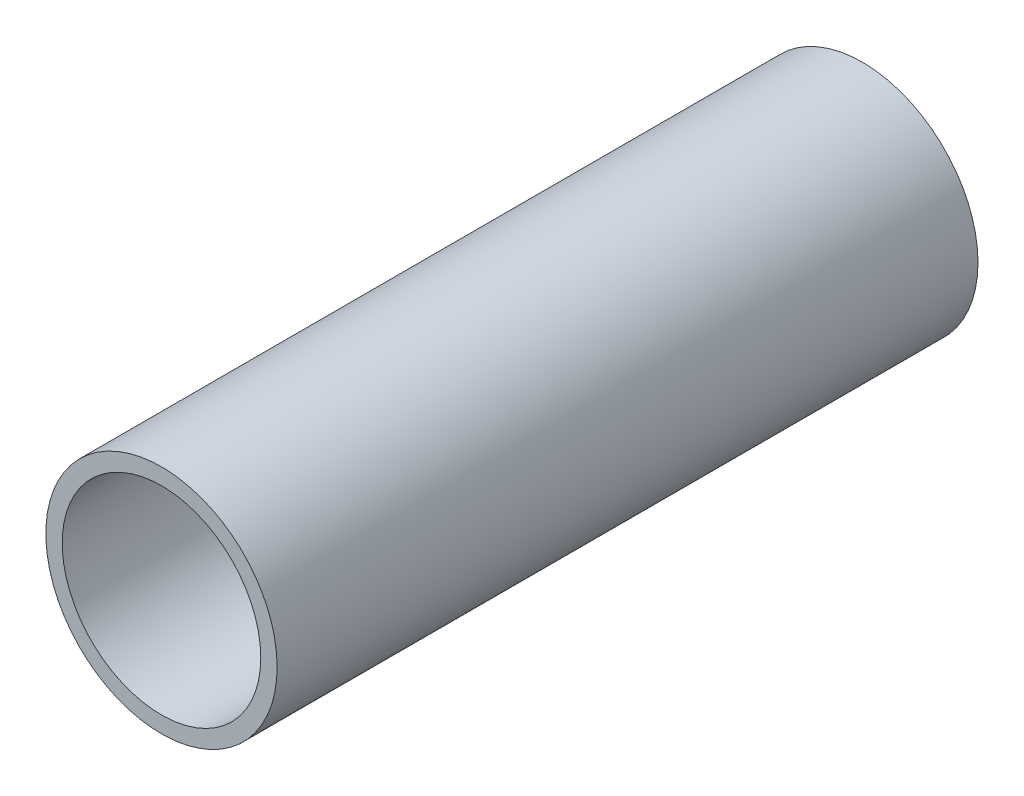
ISO-10303-21;
HEADER;
FILE_DESCRIPTION(('STEP AP214'),'2;1');
FILE_NAME('part.step','',(''),(''),'','','');
FILE_SCHEMA(('AUTOMOTIVE_DESIGN { 1 0 10303 214 1 1 1 1 }'));
ENDSEC;
DATA;
#1=APPLICATION_CONTEXT('core data for automotive mechanical design processes');
#2=APPLICATION_PROTOCOL_DEFINITION('international standard','automotive_design',2000,#1);
#3=PRODUCT_CONTEXT('',#1,'mechanical');
#4=PRODUCT('Part','Part','',(#3));
#5=PRODUCT_RELATED_PRODUCT_CATEGORY('part','',(#4));
#6=PRODUCT_DEFINITION_FORMATION('','',#4);
#7=PRODUCT_DEFINITION_CONTEXT('part definition',#1,'design');
#8=PRODUCT_DEFINITION('design','',#6,#7);
#9=PRODUCT_DEFINITION_SHAPE('','',#8);
#10=(LENGTH_UNIT() NAMED_UNIT(*) SI_UNIT(.MILLI.,.METRE.));
#11=(NAMED_UNIT(*) PLANE_ANGLE_UNIT() SI_UNIT($,.RADIAN.));
#12=(NAMED_UNIT(*) SI_UNIT($,.STERADIAN.) SOLID_ANGLE_UNIT());
#13=UNCERTAINTY_MEASURE_WITH_UNIT(LENGTH_MEASURE(1.E-05),#10,'distance_accuracy_value','');
#14=(GEOMETRIC_REPRESENTATION_CONTEXT(3) GLOBAL_UNCERTAINTY_ASSIGNED_CONTEXT((#13)) GLOBAL_UNIT_ASSIGNED_CONTEXT((#10,
#11,#12)) REPRESENTATION_CONTEXT('',''));
#15=CARTESIAN_POINT('',(0.,0.,0.));
#16=DIRECTION('',(0.,0.,1.));
#17=DIRECTION('',(1.,0.,0.));
#18=AXIS2_PLACEMENT_3D('',#15,#16,#17);
#19=CARTESIAN_POINT('',(0.,0.,76.2));
#20=DIRECTION('',(0.,0.,1.));
#21=DIRECTION('',(1.,0.,0.));
#22=AXIS2_PLACEMENT_3D('',#19,#20,#21);
#23=PLANE('',#22);
#24=CARTESIAN_POINT('',(0.,0.,76.2));
#25=DIRECTION('',(0.,0.,1.));
#26=DIRECTION('',(1.,0.,0.));
#27=AXIS2_PLACEMENT_3D('',#24,#25,#26);
#28=CIRCLE('',#27,12.573);
#29=CARTESIAN_POINT('',(12.573,0.,76.2));
#30=VERTEX_POINT('',#29);
#31=EDGE_CURVE('E10',#30,#30,#28,.T.);
#32=ORIENTED_EDGE('',*,*,#31,.T.);
#33=EDGE_LOOP('',(#32));
#34=FACE_BOUND('',#33,.T.);
#35=CARTESIAN_POINT('',(0.,0.,76.2));
#36=DIRECTION('',(0.,0.,1.));
#37=DIRECTION('',(1.,0.,0.));
#38=AXIS2_PLACEMENT_3D('',#35,#36,#37);
#39=CIRCLE('',#38,10.795);
#40=CARTESIAN_POINT('',(10.795,0.,76.2));
#41=VERTEX_POINT('',#40);
#42=EDGE_CURVE('E41',#41,#41,#39,.T.);
#43=ORIENTED_EDGE('',*,*,#42,.F.);
#44=EDGE_LOOP('',(#43));
#45=FACE_BOUND('',#44,.T.);
#46=ADVANCED_FACE('F30',(#34,#45),#23,.T.);
#47=CARTESIAN_POINT('',(0.,0.,0.));
#48=DIRECTION('',(0.,0.,1.));
#49=DIRECTION('',(1.,0.,0.));
#50=AXIS2_PLACEMENT_3D('',#47,#48,#49);
#51=PLANE('',#50);
#52=CARTESIAN_POINT('',(0.,0.,0.));
#53=DIRECTION('',(0.,0.,1.));
#54=DIRECTION('',(1.,0.,0.));
#55=AXIS2_PLACEMENT_3D('',#52,#53,#54);
#56=CIRCLE('',#55,12.573);
#57=CARTESIAN_POINT('',(12.573,0.,0.));
#58=VERTEX_POINT('',#57);
#59=EDGE_CURVE('E34',#58,#58,#56,.T.);
#60=ORIENTED_EDGE('',*,*,#59,.F.);
#61=EDGE_LOOP('',(#60));
#62=FACE_BOUND('',#61,.T.);
#63=CARTESIAN_POINT('',(0.,0.,0.));
#64=DIRECTION('',(0.,0.,1.));
#65=DIRECTION('',(1.,0.,0.));
#66=AXIS2_PLACEMENT_3D('',#63,#64,#65);
#67=CIRCLE('',#66,10.795);
#68=CARTESIAN_POINT('',(10.795,0.,0.));
#69=VERTEX_POINT('',#68);
#70=EDGE_CURVE('E43',#69,#69,#67,.T.);
#71=ORIENTED_EDGE('',*,*,#70,.T.);
#72=EDGE_LOOP('',(#71));
#73=FACE_BOUND('',#72,.T.);
#74=ADVANCED_FACE('F53',(#62,#73),#51,.F.);
#75=CARTESIAN_POINT('',(0.,0.,76.2));
#76=DIRECTION('',(0.,0.,-1.));
#77=DIRECTION('',(-1.,0.,0.));
#78=AXIS2_PLACEMENT_3D('',#75,#76,#77);
#79=CYLINDRICAL_SURFACE('',#78,12.573);
#80=ORIENTED_EDGE('',*,*,#31,.F.);
#81=EDGE_LOOP('',(#80));
#82=FACE_BOUND('',#81,.T.);
#83=ORIENTED_EDGE('',*,*,#59,.T.);
#84=EDGE_LOOP('',(#83));
#85=FACE_BOUND('',#84,.T.);
#86=ADVANCED_FACE('F32',(#82,#85),#79,.T.);
#87=CARTESIAN_POINT('',(0.,0.,76.2));
#88=DIRECTION('',(0.,0.,-1.));
#89=DIRECTION('',(-1.,0.,0.));
#90=AXIS2_PLACEMENT_3D('',#87,#88,#89);
#91=CYLINDRICAL_SURFACE('',#90,10.795);
#92=ORIENTED_EDGE('',*,*,#42,.T.);
#93=EDGE_LOOP('',(#92));
#94=FACE_BOUND('',#93,.T.);
#95=ORIENTED_EDGE('',*,*,#70,.F.);
#96=EDGE_LOOP('',(#95));
#97=FACE_BOUND('',#96,.T.);
#98=ADVANCED_FACE('F49',(#94,#97),#91,.F.);
#99=CLOSED_SHELL('',(#46,#74,#86,#98));
#100=MANIFOLD_SOLID_BREP('B2',#99);
#101=ADVANCED_BREP_SHAPE_REPRESENTATION('',(#18,#100),#14);
#102=SHAPE_DEFINITION_REPRESENTATION(#9,#101);
ENDSEC;
END-ISO-10303-21;
